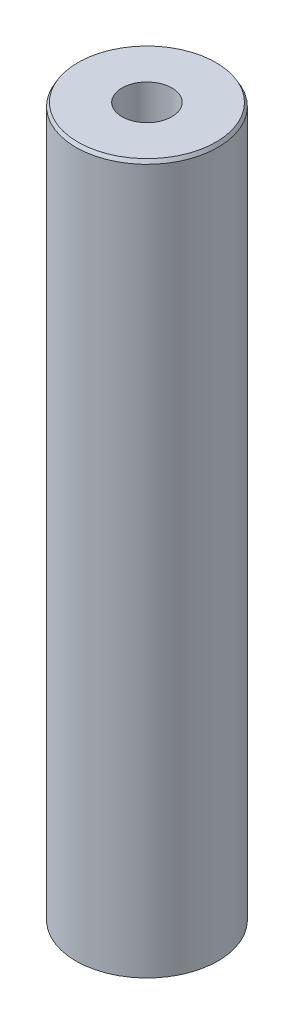
ISO-10303-21;
HEADER;
FILE_DESCRIPTION(('STEP AP214'),'2;1');
FILE_NAME('part.step','',(''),(''),'','','');
FILE_SCHEMA(('AUTOMOTIVE_DESIGN { 1 0 10303 214 1 1 1 1 }'));
ENDSEC;
DATA;
#1=APPLICATION_CONTEXT('core data for automotive mechanical design processes');
#2=APPLICATION_PROTOCOL_DEFINITION('international standard','automotive_design',2000,#1);
#3=PRODUCT_CONTEXT('',#1,'mechanical');
#4=PRODUCT('Part','Part','',(#3));
#5=PRODUCT_RELATED_PRODUCT_CATEGORY('part','',(#4));
#6=PRODUCT_DEFINITION_FORMATION('','',#4);
#7=PRODUCT_DEFINITION_CONTEXT('part definition',#1,'design');
#8=PRODUCT_DEFINITION('design','',#6,#7);
#9=PRODUCT_DEFINITION_SHAPE('','',#8);
#10=(LENGTH_UNIT() NAMED_UNIT(*) SI_UNIT(.MILLI.,.METRE.));
#11=(NAMED_UNIT(*) PLANE_ANGLE_UNIT() SI_UNIT($,.RADIAN.));
#12=(NAMED_UNIT(*) SI_UNIT($,.STERADIAN.) SOLID_ANGLE_UNIT());
#13=UNCERTAINTY_MEASURE_WITH_UNIT(LENGTH_MEASURE(1.E-05),#10,'distance_accuracy_value','');
#14=(GEOMETRIC_REPRESENTATION_CONTEXT(3) GLOBAL_UNCERTAINTY_ASSIGNED_CONTEXT((#13)) GLOBAL_UNIT_ASSIGNED_CONTEXT((#10,
#11,#12)) REPRESENTATION_CONTEXT('',''));
#15=CARTESIAN_POINT('',(0.,0.,0.));
#16=DIRECTION('',(0.,0.,1.));
#17=DIRECTION('',(1.,0.,0.));
#18=AXIS2_PLACEMENT_3D('',#15,#16,#17);
#19=CARTESIAN_POINT('',(0.,600.,0.));
#20=DIRECTION('',(0.,-1.,0.));
#21=DIRECTION('',(0.,0.,-1.));
#22=AXIS2_PLACEMENT_3D('',#19,#20,#21);
#23=CYLINDRICAL_SURFACE('',#22,60.);
#24=CARTESIAN_POINT('',(0.,597.034405895642,0.));
#25=DIRECTION('',(0.,1.,0.));
#26=DIRECTION('',(0.,0.,1.));
#27=AXIS2_PLACEMENT_3D('',#24,#25,#26);
#28=CIRCLE('',#27,60.);
#29=CARTESIAN_POINT('',(0.,597.034405895642,60.));
#30=VERTEX_POINT('',#29);
#31=EDGE_CURVE('E50',#30,#30,#28,.F.);
#32=ORIENTED_EDGE('',*,*,#31,.T.);
#33=EDGE_LOOP('',(#32));
#34=FACE_BOUND('',#33,.T.);
#35=CARTESIAN_POINT('',(0.,1.71218655445826,0.));
#36=DIRECTION('',(0.,1.,0.));
#37=DIRECTION('',(0.,0.,1.));
#38=AXIS2_PLACEMENT_3D('',#35,#36,#37);
#39=CIRCLE('',#38,60.);
#40=CARTESIAN_POINT('',(0.,1.71218655445826,60.));
#41=VERTEX_POINT('',#40);
#42=EDGE_CURVE('E51',#41,#41,#39,.T.);
#43=ORIENTED_EDGE('',*,*,#42,.T.);
#44=EDGE_LOOP('',(#43));
#45=FACE_BOUND('',#44,.T.);
#46=ADVANCED_FACE('F39',(#34,#45),#23,.T.);
#47=CARTESIAN_POINT('',(0.,600.,0.));
#48=DIRECTION('',(0.,1.,0.));
#49=DIRECTION('',(0.,0.,1.));
#50=AXIS2_PLACEMENT_3D('',#47,#48,#49);
#51=PLANE('',#50);
#52=CARTESIAN_POINT('',(0.,600.,0.));
#53=DIRECTION('',(0.,1.,0.));
#54=DIRECTION('',(0.,0.,1.));
#55=AXIS2_PLACEMENT_3D('',#52,#53,#54);
#56=CIRCLE('',#55,58.2878134455419);
#57=CARTESIAN_POINT('',(0.,600.,58.2878134455419));
#58=VERTEX_POINT('',#57);
#59=EDGE_CURVE('E54',#58,#58,#56,.T.);
#60=ORIENTED_EDGE('',*,*,#59,.T.);
#61=EDGE_LOOP('',(#60));
#62=FACE_BOUND('',#61,.T.);
#63=CARTESIAN_POINT('',(0.,600.,0.));
#64=DIRECTION('',(0.,1.,0.));
#65=DIRECTION('',(0.,0.,1.));
#66=AXIS2_PLACEMENT_3D('',#63,#64,#65);
#67=CIRCLE('',#66,21.0891421188683);
#68=CARTESIAN_POINT('',(0.,600.,21.0891421188683));
#69=VERTEX_POINT('',#68);
#70=EDGE_CURVE('E58',#69,#69,#67,.T.);
#71=ORIENTED_EDGE('',*,*,#70,.F.);
#72=EDGE_LOOP('',(#71));
#73=FACE_BOUND('',#72,.T.);
#74=ADVANCED_FACE('F69',(#62,#73),#51,.T.);
#75=CARTESIAN_POINT('',(0.,0.,0.));
#76=DIRECTION('',(0.,1.,0.));
#77=DIRECTION('',(0.,0.,1.));
#78=AXIS2_PLACEMENT_3D('',#75,#76,#77);
#79=PLANE('',#78);
#80=CARTESIAN_POINT('',(0.,0.,0.));
#81=DIRECTION('',(0.,1.,0.));
#82=DIRECTION('',(0.,0.,1.));
#83=AXIS2_PLACEMENT_3D('',#80,#81,#82);
#84=CIRCLE('',#83,57.0344058956419);
#85=CARTESIAN_POINT('',(0.,0.,57.0344058956419));
#86=VERTEX_POINT('',#85);
#87=EDGE_CURVE('E10',#86,#86,#84,.F.);
#88=ORIENTED_EDGE('',*,*,#87,.T.);
#89=EDGE_LOOP('',(#88));
#90=FACE_BOUND('',#89,.T.);
#91=CARTESIAN_POINT('',(0.,0.,0.));
#92=DIRECTION('',(0.,1.,0.));
#93=DIRECTION('',(0.,0.,1.));
#94=AXIS2_PLACEMENT_3D('',#91,#92,#93);
#95=CIRCLE('',#94,21.0891421188683);
#96=CARTESIAN_POINT('',(0.,0.,21.0891421188683));
#97=VERTEX_POINT('',#96);
#98=EDGE_CURVE('E63',#97,#97,#95,.T.);
#99=ORIENTED_EDGE('',*,*,#98,.T.);
#100=EDGE_LOOP('',(#99));
#101=FACE_BOUND('',#100,.T.);
#102=ADVANCED_FACE('F75',(#90,#101),#79,.F.);
#103=CARTESIAN_POINT('',(0.,600.,0.));
#104=DIRECTION('',(0.,-1.,0.));
#105=DIRECTION('',(0.,0.,-1.));
#106=AXIS2_PLACEMENT_3D('',#103,#104,#105);
#107=CYLINDRICAL_SURFACE('',#106,21.0891421188683);
#108=ORIENTED_EDGE('',*,*,#70,.T.);
#109=EDGE_LOOP('',(#108));
#110=FACE_BOUND('',#109,.T.);
#111=ORIENTED_EDGE('',*,*,#98,.F.);
#112=EDGE_LOOP('',(#111));
#113=FACE_BOUND('',#112,.T.);
#114=ADVANCED_FACE('F70',(#110,#113),#107,.F.);
#115=CARTESIAN_POINT('',(0.,600.,0.));
#116=DIRECTION('',(0.,-1.,0.));
#117=DIRECTION('',(0.,0.,-1.));
#118=AXIS2_PLACEMENT_3D('',#115,#116,#117);
#119=CONICAL_SURFACE('',#118,58.2878134455419,0.523598775598284);
#120=ORIENTED_EDGE('',*,*,#31,.F.);
#121=EDGE_LOOP('',(#120));
#122=FACE_BOUND('',#121,.T.);
#123=ORIENTED_EDGE('',*,*,#59,.F.);
#124=EDGE_LOOP('',(#123));
#125=FACE_BOUND('',#124,.T.);
#126=ADVANCED_FACE('F81',(#122,#125),#119,.T.);
#127=CARTESIAN_POINT('',(0.,1.71218655445826,0.));
#128=DIRECTION('',(0.,1.,0.));
#129=DIRECTION('',(0.,0.,1.));
#130=AXIS2_PLACEMENT_3D('',#127,#128,#129);
#131=CONICAL_SURFACE('',#130,60.,1.04719755119661);
#132=ORIENTED_EDGE('',*,*,#87,.F.);
#133=EDGE_LOOP('',(#132));
#134=FACE_BOUND('',#133,.T.);
#135=ORIENTED_EDGE('',*,*,#42,.F.);
#136=EDGE_LOOP('',(#135));
#137=FACE_BOUND('',#136,.T.);
#138=ADVANCED_FACE('F45',(#134,#137),#131,.T.);
#139=CLOSED_SHELL('',(#46,#74,#102,#114,#126,#138));
#140=MANIFOLD_SOLID_BREP('B2',#139);
#141=ADVANCED_BREP_SHAPE_REPRESENTATION('',(#18,#140),#14);
#142=SHAPE_DEFINITION_REPRESENTATION(#9,#141);
ENDSEC;
END-ISO-10303-21;
